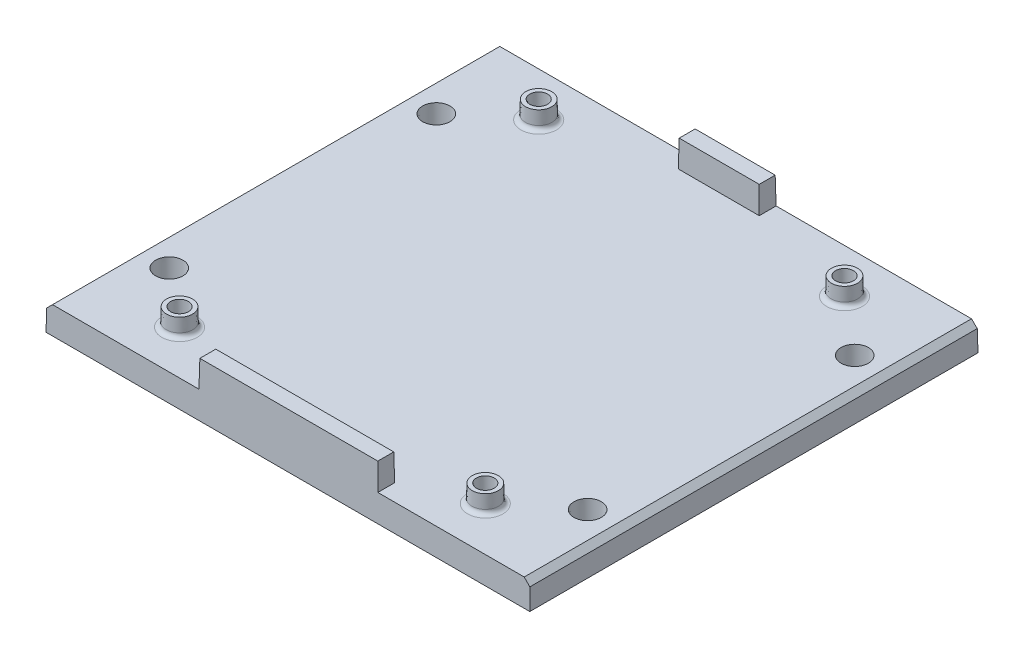
ISO-10303-21;
HEADER;
FILE_DESCRIPTION(('STEP AP214'),'2;1');
FILE_NAME('part.step','',(''),(''),'','','');
FILE_SCHEMA(('AUTOMOTIVE_DESIGN { 1 0 10303 214 1 1 1 1 }'));
ENDSEC;
DATA;
#1=APPLICATION_CONTEXT('core data for automotive mechanical design processes');
#2=APPLICATION_PROTOCOL_DEFINITION('international standard','automotive_design',2000,#1);
#3=PRODUCT_CONTEXT('',#1,'mechanical');
#4=PRODUCT('Part','Part','',(#3));
#5=PRODUCT_RELATED_PRODUCT_CATEGORY('part','',(#4));
#6=PRODUCT_DEFINITION_FORMATION('','',#4);
#7=PRODUCT_DEFINITION_CONTEXT('part definition',#1,'design');
#8=PRODUCT_DEFINITION('design','',#6,#7);
#9=PRODUCT_DEFINITION_SHAPE('','',#8);
#10=(LENGTH_UNIT() NAMED_UNIT(*) SI_UNIT(.MILLI.,.METRE.));
#11=(NAMED_UNIT(*) PLANE_ANGLE_UNIT() SI_UNIT($,.RADIAN.));
#12=(NAMED_UNIT(*) SI_UNIT($,.STERADIAN.) SOLID_ANGLE_UNIT());
#13=UNCERTAINTY_MEASURE_WITH_UNIT(LENGTH_MEASURE(1.E-05),#10,'distance_accuracy_value','');
#14=(GEOMETRIC_REPRESENTATION_CONTEXT(3) GLOBAL_UNCERTAINTY_ASSIGNED_CONTEXT((#13)) GLOBAL_UNIT_ASSIGNED_CONTEXT((#10,
#11,#12)) REPRESENTATION_CONTEXT('',''));
#15=CARTESIAN_POINT('',(0.,0.,0.));
#16=DIRECTION('',(0.,0.,1.));
#17=DIRECTION('',(1.,0.,0.));
#18=AXIS2_PLACEMENT_3D('',#15,#16,#17);
#19=CARTESIAN_POINT('',(0.,3.,0.));
#20=DIRECTION('',(0.,1.,0.));
#21=DIRECTION('',(0.,0.,1.));
#22=AXIS2_PLACEMENT_3D('',#19,#20,#21);
#23=PLANE('',#22);
#24=CARTESIAN_POINT('',(47.1745506492822,3.,-4.82544935071782));
#25=DIRECTION('',(0.,1.,0.));
#26=DIRECTION('',(0.,0.,1.));
#27=AXIS2_PLACEMENT_3D('',#24,#25,#26);
#28=CIRCLE('',#27,1.99134863155785);
#29=CARTESIAN_POINT('',(47.1745506492822,3.,-2.83410071915998));
#30=VERTEX_POINT('',#29);
#31=EDGE_CURVE('E260',#30,#30,#28,.F.);
#32=ORIENTED_EDGE('',*,*,#31,.T.);
#33=EDGE_LOOP('',(#32));
#34=FACE_BOUND('',#33,.T.);
#35=CARTESIAN_POINT('',(12.8254493507178,3.,-45.1745506492822));
#36=DIRECTION('',(0.,1.,0.));
#37=DIRECTION('',(0.,0.,1.));
#38=AXIS2_PLACEMENT_3D('',#35,#36,#37);
#39=CIRCLE('',#38,1.99134863155785);
#40=CARTESIAN_POINT('',(12.8254493507178,3.,-43.1832020177243));
#41=VERTEX_POINT('',#40);
#42=EDGE_CURVE('E263',#41,#41,#39,.F.);
#43=ORIENTED_EDGE('',*,*,#42,.T.);
#44=EDGE_LOOP('',(#43));
#45=FACE_BOUND('',#44,.T.);
#46=CARTESIAN_POINT('',(47.1745506492822,3.,-45.1745506492822));
#47=DIRECTION('',(0.,1.,0.));
#48=DIRECTION('',(0.,0.,1.));
#49=AXIS2_PLACEMENT_3D('',#46,#47,#48);
#50=CIRCLE('',#49,1.99134863155785);
#51=CARTESIAN_POINT('',(47.1745506492822,3.,-43.1832020177243));
#52=VERTEX_POINT('',#51);
#53=EDGE_CURVE('E266',#52,#52,#50,.F.);
#54=ORIENTED_EDGE('',*,*,#53,.T.);
#55=EDGE_LOOP('',(#54));
#56=FACE_BOUND('',#55,.T.);
#57=CARTESIAN_POINT('',(12.8254493507178,3.,-4.82544935071782));
#58=DIRECTION('',(0.,1.,0.));
#59=DIRECTION('',(0.,0.,1.));
#60=AXIS2_PLACEMENT_3D('',#57,#58,#59);
#61=CIRCLE('',#60,1.99134863155785);
#62=CARTESIAN_POINT('',(12.8254493507178,3.,-2.83410071915998));
#63=VERTEX_POINT('',#62);
#64=EDGE_CURVE('E269',#63,#63,#61,.F.);
#65=ORIENTED_EDGE('',*,*,#64,.T.);
#66=EDGE_LOOP('',(#65));
#67=FACE_BOUND('',#66,.T.);
#68=CARTESIAN_POINT('',(53.5,3.,-40.));
#69=DIRECTION('',(0.,1.,0.));
#70=DIRECTION('',(0.,0.,1.));
#71=AXIS2_PLACEMENT_3D('',#68,#69,#70);
#72=CIRCLE('',#71,1.53491012985645);
#73=CARTESIAN_POINT('',(53.5,3.,-38.4650898701436));
#74=VERTEX_POINT('',#73);
#75=EDGE_CURVE('E242',#74,#74,#72,.T.);
#76=ORIENTED_EDGE('',*,*,#75,.F.);
#77=EDGE_LOOP('',(#76));
#78=FACE_BOUND('',#77,.T.);
#79=CARTESIAN_POINT('',(53.5,3.,-10.));
#80=DIRECTION('',(0.,1.,0.));
#81=DIRECTION('',(0.,0.,1.));
#82=AXIS2_PLACEMENT_3D('',#79,#80,#81);
#83=CIRCLE('',#82,1.53491012985645);
#84=CARTESIAN_POINT('',(53.5,3.,-8.46508987014355));
#85=VERTEX_POINT('',#84);
#86=EDGE_CURVE('E286',#85,#85,#83,.T.);
#87=ORIENTED_EDGE('',*,*,#86,.F.);
#88=EDGE_LOOP('',(#87));
#89=FACE_BOUND('',#88,.T.);
#90=CARTESIAN_POINT('',(6.5,3.,-10.));
#91=DIRECTION('',(0.,1.,0.));
#92=DIRECTION('',(0.,0.,1.));
#93=AXIS2_PLACEMENT_3D('',#90,#91,#92);
#94=CIRCLE('',#93,1.53491012985644);
#95=CARTESIAN_POINT('',(6.5,3.,-8.46508987014357));
#96=VERTEX_POINT('',#95);
#97=EDGE_CURVE('E292',#96,#96,#94,.T.);
#98=ORIENTED_EDGE('',*,*,#97,.F.);
#99=EDGE_LOOP('',(#98));
#100=FACE_BOUND('',#99,.T.);
#101=CARTESIAN_POINT('',(6.5,3.,-40.));
#102=DIRECTION('',(0.,1.,0.));
#103=DIRECTION('',(0.,0.,1.));
#104=AXIS2_PLACEMENT_3D('',#101,#102,#103);
#105=CIRCLE('',#104,1.53491012985644);
#106=CARTESIAN_POINT('',(6.5,3.,-38.4650898701436));
#107=VERTEX_POINT('',#106);
#108=EDGE_CURVE('E279',#107,#107,#105,.T.);
#109=ORIENTED_EDGE('',*,*,#108,.F.);
#110=EDGE_LOOP('',(#109));
#111=FACE_BOUND('',#110,.T.);
#112=DIRECTION('',(-1.,0.,0.));
#113=VECTOR('',#112,1.);
#114=CARTESIAN_POINT('',(0.,3.,0.122185454497519));
#115=LINE('',#114,#113);
#116=CARTESIAN_POINT('',(40.0476348052153,3.,0.122185454497522));
#117=VERTEX_POINT('',#116);
#118=CARTESIAN_POINT('',(56.4945506492822,3.,0.122185454497523));
#119=VERTEX_POINT('',#118);
#120=EDGE_CURVE('E160',#117,#119,#115,.F.);
#121=ORIENTED_EDGE('',*,*,#120,.T.);
#122=DIRECTION('',(0.,0.,-1.));
#123=VECTOR('',#122,1.);
#124=CARTESIAN_POINT('',(56.4945506492822,3.,0.));
#125=LINE('',#124,#123);
#126=CARTESIAN_POINT('',(56.4945506492822,3.,-50.1221854544975));
#127=VERTEX_POINT('',#126);
#128=EDGE_CURVE('E217',#119,#127,#125,.T.);
#129=ORIENTED_EDGE('',*,*,#128,.T.);
#130=DIRECTION('',(1.,0.,0.));
#131=VECTOR('',#130,1.);
#132=CARTESIAN_POINT('',(0.,3.,-50.1221854544975));
#133=LINE('',#132,#131);
#134=CARTESIAN_POINT('',(34.5476348052153,3.,-50.1221854544975));
#135=VERTEX_POINT('',#134);
#136=EDGE_CURVE('E213',#135,#127,#133,.T.);
#137=ORIENTED_EDGE('',*,*,#136,.F.);
#138=DIRECTION('',(0.,0.,1.));
#139=VECTOR('',#138,1.);
#140=CARTESIAN_POINT('',(34.5476348052153,3.,0.));
#141=LINE('',#140,#139);
#142=CARTESIAN_POINT('',(34.5476348052153,3.,-48.2269158440668));
#143=VERTEX_POINT('',#142);
#144=EDGE_CURVE('E204',#143,#135,#141,.F.);
#145=ORIENTED_EDGE('',*,*,#144,.F.);
#146=DIRECTION('',(-1.,0.,0.));
#147=VECTOR('',#146,1.);
#148=CARTESIAN_POINT('',(0.,3.,-48.2269158440668));
#149=LINE('',#148,#147);
#150=CARTESIAN_POINT('',(25.4523651947846,3.,-48.2269158440668));
#151=VERTEX_POINT('',#150);
#152=EDGE_CURVE('E190',#151,#143,#149,.F.);
#153=ORIENTED_EDGE('',*,*,#152,.F.);
#154=DIRECTION('',(0.,0.,-1.));
#155=VECTOR('',#154,1.);
#156=CARTESIAN_POINT('',(25.4523651947846,3.,0.));
#157=LINE('',#156,#155);
#158=CARTESIAN_POINT('',(25.4523651947846,3.,-50.1221854544975));
#159=VERTEX_POINT('',#158);
#160=EDGE_CURVE('E196',#159,#151,#157,.F.);
#161=ORIENTED_EDGE('',*,*,#160,.F.);
#162=DIRECTION('',(1.,0.,0.));
#163=VECTOR('',#162,1.);
#164=CARTESIAN_POINT('',(0.,3.,-50.1221854544975));
#165=LINE('',#164,#163);
#166=CARTESIAN_POINT('',(3.50544935071782,3.,-50.1221854544975));
#167=VERTEX_POINT('',#166);
#168=EDGE_CURVE('E209',#167,#159,#165,.T.);
#169=ORIENTED_EDGE('',*,*,#168,.F.);
#170=DIRECTION('',(0.,0.,1.));
#171=VECTOR('',#170,1.);
#172=CARTESIAN_POINT('',(3.50544935071782,3.,0.174550649282172));
#173=LINE('',#172,#171);
#174=CARTESIAN_POINT('',(3.50544935071782,3.,0.122185454497519));
#175=VERTEX_POINT('',#174);
#176=EDGE_CURVE('E167',#167,#175,#173,.T.);
#177=ORIENTED_EDGE('',*,*,#176,.T.);
#178=DIRECTION('',(-1.,0.,0.));
#179=VECTOR('',#178,1.);
#180=CARTESIAN_POINT('',(0.,3.,0.122185454497519));
#181=LINE('',#180,#179);
#182=CARTESIAN_POINT('',(19.9523651947847,3.,0.122185454497521));
#183=VERTEX_POINT('',#182);
#184=EDGE_CURVE('E163',#175,#183,#181,.F.);
#185=ORIENTED_EDGE('',*,*,#184,.T.);
#186=DIRECTION('',(0.,0.,-1.));
#187=VECTOR('',#186,1.);
#188=CARTESIAN_POINT('',(19.9523651947847,3.,0.));
#189=LINE('',#188,#187);
#190=CARTESIAN_POINT('',(19.9523651947847,3.,-1.77308415593317));
#191=VERTEX_POINT('',#190);
#192=EDGE_CURVE('E155',#191,#183,#189,.F.);
#193=ORIENTED_EDGE('',*,*,#192,.F.);
#194=DIRECTION('',(1.,0.,0.));
#195=VECTOR('',#194,1.);
#196=CARTESIAN_POINT('',(0.,3.,-1.77308415593317));
#197=LINE('',#196,#195);
#198=CARTESIAN_POINT('',(40.0476348052153,3.,-1.77308415593317));
#199=VERTEX_POINT('',#198);
#200=EDGE_CURVE('E142',#199,#191,#197,.F.);
#201=ORIENTED_EDGE('',*,*,#200,.F.);
#202=DIRECTION('',(0.,0.,1.));
#203=VECTOR('',#202,1.);
#204=CARTESIAN_POINT('',(40.0476348052153,3.,0.));
#205=LINE('',#204,#203);
#206=EDGE_CURVE('E152',#117,#199,#205,.F.);
#207=ORIENTED_EDGE('',*,*,#206,.F.);
#208=EDGE_LOOP('',(#121,#129,#137,#145,#153,#161,#169,#177,#185,#193,#201,#207));
#209=FACE_BOUND('',#208,.T.);
#210=ADVANCED_FACE('F42',(#34,#45,#56,#67,#78,#89,#100,#111,#209),#23,.T.);
#211=CARTESIAN_POINT('',(2.82544935071782,0.,0.));
#212=DIRECTION('',(-0.999847695156391,0.0174524064372835,0.));
#213=DIRECTION('',(-0.0174524064372835,-0.999847695156391,0.));
#214=AXIS2_PLACEMENT_3D('',#211,#212,#213);
#215=PLANE('',#214);
#216=DIRECTION('',(-0.0174497491606827,-0.999695459881887,0.0174497491606827));
#217=VECTOR('',#216,1.);
#218=CARTESIAN_POINT('',(2.82458901906154,-0.0492883675783294,0.175410980938458));
#219=LINE('',#218,#217);
#220=CARTESIAN_POINT('',(2.86666451471488,2.36121516399706,0.133335485285111));
#221=VERTEX_POINT('',#220);
#222=CARTESIAN_POINT('',(2.82544935071782,0.,0.174550649282172));
#223=VERTEX_POINT('',#222);
#224=EDGE_CURVE('E234',#221,#223,#219,.T.);
#225=ORIENTED_EDGE('',*,*,#224,.F.);
#226=DIRECTION('',(0.,0.,1.));
#227=VECTOR('',#226,1.);
#228=CARTESIAN_POINT('',(2.86666451471488,2.36121516399706,0.));
#229=LINE('',#228,#227);
#230=CARTESIAN_POINT('',(2.86666451471488,2.36121516399706,-50.1333354852851));
#231=VERTEX_POINT('',#230);
#232=EDGE_CURVE('E61',#221,#231,#229,.F.);
#233=ORIENTED_EDGE('',*,*,#232,.T.);
#234=DIRECTION('',(0.0174497491606827,0.999695459881887,0.0174497491606827));
#235=VECTOR('',#234,1.);
#236=CARTESIAN_POINT('',(2.82458901906154,-0.0492883675783293,-50.1754109809385));
#237=LINE('',#236,#235);
#238=CARTESIAN_POINT('',(2.82544935071782,0.,-50.1745506492822));
#239=VERTEX_POINT('',#238);
#240=EDGE_CURVE('E212',#231,#239,#237,.F.);
#241=ORIENTED_EDGE('',*,*,#240,.T.);
#242=DIRECTION('',(0.,0.,-1.));
#243=VECTOR('',#242,1.);
#244=CARTESIAN_POINT('',(2.82544935071782,0.,0.));
#245=LINE('',#244,#243);
#246=EDGE_CURVE('E175',#239,#223,#245,.F.);
#247=ORIENTED_EDGE('',*,*,#246,.T.);
#248=EDGE_LOOP('',(#225,#233,#241,#247));
#249=FACE_BOUND('',#248,.T.);
#250=ADVANCED_FACE('F358',(#249),#215,.T.);
#251=CARTESIAN_POINT('',(0.,0.,0.174550649282172));
#252=DIRECTION('',(0.,0.0174524064372835,0.999847695156391));
#253=DIRECTION('',(0.,-0.999847695156391,0.0174524064372835));
#254=AXIS2_PLACEMENT_3D('',#251,#252,#253);
#255=PLANE('',#254);
#256=DIRECTION('',(-0.0174497491606827,0.999695459881887,-0.0174497491606827));
#257=VECTOR('',#256,1.);
#258=CARTESIAN_POINT('',(57.1571413561922,0.997377733142408,0.157141356192217));
#259=LINE('',#258,#257);
#260=CARTESIAN_POINT('',(57.1333354852851,2.36121516399706,0.133335485285115));
#261=VERTEX_POINT('',#260);
#262=CARTESIAN_POINT('',(57.1745506492822,0.,0.174550649282176));
#263=VERTEX_POINT('',#262);
#264=EDGE_CURVE('E246',#261,#263,#259,.F.);
#265=ORIENTED_EDGE('',*,*,#264,.F.);
#266=DIRECTION('',(-0.707052927141246,0.707052927141246,-0.0123416547509368));
#267=VECTOR('',#266,1.);
#268=CARTESIAN_POINT('',(56.7355475387169,2.75900311056523,0.126392070850107));
#269=LINE('',#268,#267);
#270=EDGE_CURVE('E165',#261,#119,#269,.T.);
#271=ORIENTED_EDGE('',*,*,#270,.T.);
#272=ORIENTED_EDGE('',*,*,#120,.F.);
#273=DIRECTION('',(0.0174497491606827,-0.999695459881887,0.0174497491606827));
#274=VECTOR('',#273,1.);
#275=CARTESIAN_POINT('',(40.099946850419,0.00304493745770745,0.174497499701148));
#276=LINE('',#275,#274);
#277=CARTESIAN_POINT('',(39.9952696104307,6.,0.0698202597128692));
#278=VERTEX_POINT('',#277);
#279=EDGE_CURVE('E239',#278,#117,#276,.T.);
#280=ORIENTED_EDGE('',*,*,#279,.F.);
#281=DIRECTION('',(-1.,0.,0.));
#282=VECTOR('',#281,1.);
#283=CARTESIAN_POINT('',(0.,6.,0.0698202597128662));
#284=LINE('',#283,#282);
#285=CARTESIAN_POINT('',(20.0047303895693,6.,0.0698202597128677));
#286=VERTEX_POINT('',#285);
#287=EDGE_CURVE('E150',#286,#278,#284,.F.);
#288=ORIENTED_EDGE('',*,*,#287,.F.);
#289=DIRECTION('',(-0.0174497491606827,-0.999695459881887,0.0174497491606827));
#290=VECTOR('',#289,1.);
#291=CARTESIAN_POINT('',(19.8939405744592,-0.347144256739045,0.180610074823011));
#292=LINE('',#291,#290);
#293=EDGE_CURVE('E149',#286,#183,#292,.T.);
#294=ORIENTED_EDGE('',*,*,#293,.T.);
#295=ORIENTED_EDGE('',*,*,#184,.F.);
#296=DIRECTION('',(0.707052927141246,0.707052927141246,-0.0123416547509367));
#297=VECTOR('',#296,1.);
#298=CARTESIAN_POINT('',(3.50651556581176,3.00106621509394,0.122166843643827));
#299=LINE('',#298,#297);
#300=EDGE_CURVE('E168',#175,#221,#299,.F.);
#301=ORIENTED_EDGE('',*,*,#300,.T.);
#302=ORIENTED_EDGE('',*,*,#224,.T.);
#303=DIRECTION('',(-1.,0.,0.));
#304=VECTOR('',#303,1.);
#305=CARTESIAN_POINT('',(0.,0.,0.174550649282172));
#306=LINE('',#305,#304);
#307=EDGE_CURVE('E172',#223,#263,#306,.F.);
#308=ORIENTED_EDGE('',*,*,#307,.T.);
#309=EDGE_LOOP('',(#265,#271,#272,#280,#288,#294,#295,#301,#302,#308));
#310=FACE_BOUND('',#309,.T.);
#311=ADVANCED_FACE('F44',(#310),#255,.T.);
#312=CARTESIAN_POINT('',(57.1745506492822,0.,0.));
#313=DIRECTION('',(0.999847695156391,0.0174524064372835,0.));
#314=DIRECTION('',(-0.0174524064372835,0.999847695156391,0.));
#315=AXIS2_PLACEMENT_3D('',#312,#313,#314);
#316=PLANE('',#315);
#317=DIRECTION('',(0.0174497491606827,-0.999695459881887,-0.0174497491606827));
#318=VECTOR('',#317,1.);
#319=CARTESIAN_POINT('',(57.1571413561922,0.997377733142408,-50.1571413561922));
#320=LINE('',#319,#318);
#321=CARTESIAN_POINT('',(57.1333354852851,2.36121516399706,-50.1333354852851));
#322=VERTEX_POINT('',#321);
#323=CARTESIAN_POINT('',(57.1745506492822,0.,-50.1745506492822));
#324=VERTEX_POINT('',#323);
#325=EDGE_CURVE('E252',#322,#324,#320,.T.);
#326=ORIENTED_EDGE('',*,*,#325,.F.);
#327=DIRECTION('',(0.,0.,-1.));
#328=VECTOR('',#327,1.);
#329=CARTESIAN_POINT('',(57.1333354852851,2.36121516399706,0.));
#330=LINE('',#329,#328);
#331=EDGE_CURVE('E220',#322,#261,#330,.F.);
#332=ORIENTED_EDGE('',*,*,#331,.T.);
#333=ORIENTED_EDGE('',*,*,#264,.T.);
#334=DIRECTION('',(0.,0.,1.));
#335=VECTOR('',#334,1.);
#336=CARTESIAN_POINT('',(57.1745506492822,0.,0.));
#337=LINE('',#336,#335);
#338=EDGE_CURVE('E169',#324,#263,#337,.T.);
#339=ORIENTED_EDGE('',*,*,#338,.F.);
#340=EDGE_LOOP('',(#326,#332,#333,#339));
#341=FACE_BOUND('',#340,.T.);
#342=ADVANCED_FACE('F402',(#341),#316,.T.);
#343=CARTESIAN_POINT('',(0.,0.,-50.1745506492822));
#344=DIRECTION('',(0.,0.0174524064372835,-0.999847695156391));
#345=DIRECTION('',(0.,0.999847695156391,0.0174524064372835));
#346=AXIS2_PLACEMENT_3D('',#343,#344,#345);
#347=PLANE('',#346);
#348=ORIENTED_EDGE('',*,*,#136,.T.);
#349=DIRECTION('',(-0.707052927141246,0.707052927141246,0.0123416547509367));
#350=VECTOR('',#349,1.);
#351=CARTESIAN_POINT('',(29.7518063237775,29.7427443255047,-49.6553891159371));
#352=LINE('',#351,#350);
#353=EDGE_CURVE('E216',#127,#322,#352,.F.);
#354=ORIENTED_EDGE('',*,*,#353,.T.);
#355=ORIENTED_EDGE('',*,*,#325,.T.);
#356=DIRECTION('',(1.,0.,0.));
#357=VECTOR('',#356,1.);
#358=CARTESIAN_POINT('',(0.,0.,-50.1745506492822));
#359=LINE('',#358,#357);
#360=EDGE_CURVE('E164',#239,#324,#359,.T.);
#361=ORIENTED_EDGE('',*,*,#360,.F.);
#362=ORIENTED_EDGE('',*,*,#240,.F.);
#363=DIRECTION('',(0.707052927141246,0.707052927141246,0.0123416547509369));
#364=VECTOR('',#363,1.);
#365=CARTESIAN_POINT('',(0.252763169482269,-0.252686181235554,-50.1789613029821));
#366=LINE('',#365,#364);
#367=EDGE_CURVE('E214',#231,#167,#366,.T.);
#368=ORIENTED_EDGE('',*,*,#367,.T.);
#369=ORIENTED_EDGE('',*,*,#168,.T.);
#370=DIRECTION('',(0.0174497491606827,0.999695459881887,0.0174497491606827));
#371=VECTOR('',#370,1.);
#372=CARTESIAN_POINT('',(25.3922658588574,-0.443088649305112,-50.1822847904248));
#373=LINE('',#372,#371);
#374=CARTESIAN_POINT('',(25.5047303895693,6.,-50.0698202597129));
#375=VERTEX_POINT('',#374);
#376=EDGE_CURVE('E238',#375,#159,#373,.F.);
#377=ORIENTED_EDGE('',*,*,#376,.F.);
#378=DIRECTION('',(-1.,0.,0.));
#379=VECTOR('',#378,1.);
#380=CARTESIAN_POINT('',(0.,6.,-50.0698202597129));
#381=LINE('',#380,#379);
#382=CARTESIAN_POINT('',(34.4952696104307,6.,-50.0698202597129));
#383=VERTEX_POINT('',#382);
#384=EDGE_CURVE('E181',#383,#375,#381,.T.);
#385=ORIENTED_EDGE('',*,*,#384,.F.);
#386=DIRECTION('',(-0.0174497491606827,0.999695459881887,0.0174497491606827));
#387=VECTOR('',#386,1.);
#388=CARTESIAN_POINT('',(34.5847221631304,0.875266688058322,-50.1592728124126));
#389=LINE('',#388,#387);
#390=EDGE_CURVE('E247',#383,#135,#389,.F.);
#391=ORIENTED_EDGE('',*,*,#390,.T.);
#392=EDGE_LOOP('',(#348,#354,#355,#361,#362,#368,#369,#377,#385,#391));
#393=FACE_BOUND('',#392,.T.);
#394=ADVANCED_FACE('F373',(#393),#347,.T.);
#395=CARTESIAN_POINT('',(0.,0.,0.));
#396=DIRECTION('',(0.,1.,0.));
#397=DIRECTION('',(0.,0.,1.));
#398=AXIS2_PLACEMENT_3D('',#395,#396,#397);
#399=PLANE('',#398);
#400=CARTESIAN_POINT('',(53.5,0.,-40.));
#401=DIRECTION('',(0.,1.,0.));
#402=DIRECTION('',(0.,0.,1.));
#403=AXIS2_PLACEMENT_3D('',#400,#401,#402);
#404=CIRCLE('',#403,1.4825449350718);
#405=CARTESIAN_POINT('',(53.5,0.,-38.5174550649282));
#406=VERTEX_POINT('',#405);
#407=EDGE_CURVE('E283',#406,#406,#404,.T.);
#408=ORIENTED_EDGE('',*,*,#407,.T.);
#409=EDGE_LOOP('',(#408));
#410=FACE_BOUND('',#409,.T.);
#411=CARTESIAN_POINT('',(53.5,0.,-10.));
#412=DIRECTION('',(0.,1.,0.));
#413=DIRECTION('',(0.,0.,1.));
#414=AXIS2_PLACEMENT_3D('',#411,#412,#413);
#415=CIRCLE('',#414,1.4825449350718);
#416=CARTESIAN_POINT('',(53.5,0.,-8.5174550649282));
#417=VERTEX_POINT('',#416);
#418=EDGE_CURVE('E289',#417,#417,#415,.T.);
#419=ORIENTED_EDGE('',*,*,#418,.T.);
#420=EDGE_LOOP('',(#419));
#421=FACE_BOUND('',#420,.T.);
#422=CARTESIAN_POINT('',(6.5,0.,-10.));
#423=DIRECTION('',(0.,1.,0.));
#424=DIRECTION('',(0.,0.,1.));
#425=AXIS2_PLACEMENT_3D('',#422,#423,#424);
#426=CIRCLE('',#425,1.48254493507178);
#427=CARTESIAN_POINT('',(6.5,0.,-8.51745506492822));
#428=VERTEX_POINT('',#427);
#429=EDGE_CURVE('E282',#428,#428,#426,.T.);
#430=ORIENTED_EDGE('',*,*,#429,.T.);
#431=EDGE_LOOP('',(#430));
#432=FACE_BOUND('',#431,.T.);
#433=CARTESIAN_POINT('',(6.5,0.,-40.));
#434=DIRECTION('',(0.,1.,0.));
#435=DIRECTION('',(0.,0.,1.));
#436=AXIS2_PLACEMENT_3D('',#433,#434,#435);
#437=CIRCLE('',#436,1.48254493507178);
#438=CARTESIAN_POINT('',(6.5,0.,-38.5174550649282));
#439=VERTEX_POINT('',#438);
#440=EDGE_CURVE('E178',#439,#439,#437,.T.);
#441=ORIENTED_EDGE('',*,*,#440,.T.);
#442=EDGE_LOOP('',(#441));
#443=FACE_BOUND('',#442,.T.);
#444=ORIENTED_EDGE('',*,*,#246,.F.);
#445=ORIENTED_EDGE('',*,*,#360,.T.);
#446=ORIENTED_EDGE('',*,*,#338,.T.);
#447=ORIENTED_EDGE('',*,*,#307,.F.);
#448=EDGE_LOOP('',(#444,#445,#446,#447));
#449=FACE_BOUND('',#448,.T.);
#450=ADVANCED_FACE('F370',(#410,#421,#432,#443,#449),#399,.F.);
#451=CARTESIAN_POINT('',(6.5,3.,-40.));
#452=DIRECTION('',(0.,1.,0.));
#453=DIRECTION('',(0.,0.,1.));
#454=AXIS2_PLACEMENT_3D('',#451,#452,#453);
#455=CONICAL_SURFACE('',#454,1.53491012985644,0.0174532925199433);
#456=ORIENTED_EDGE('',*,*,#440,.F.);
#457=EDGE_LOOP('',(#456));
#458=FACE_BOUND('',#457,.T.);
#459=ORIENTED_EDGE('',*,*,#108,.T.);
#460=EDGE_LOOP('',(#459));
#461=FACE_BOUND('',#460,.T.);
#462=ADVANCED_FACE('F368',(#458,#461),#455,.F.);
#463=CARTESIAN_POINT('',(6.5,3.,-10.));
#464=DIRECTION('',(0.,1.,0.));
#465=DIRECTION('',(0.,0.,1.));
#466=AXIS2_PLACEMENT_3D('',#463,#464,#465);
#467=CONICAL_SURFACE('',#466,1.53491012985644,0.0174532925199433);
#468=ORIENTED_EDGE('',*,*,#429,.F.);
#469=EDGE_LOOP('',(#468));
#470=FACE_BOUND('',#469,.T.);
#471=ORIENTED_EDGE('',*,*,#97,.T.);
#472=EDGE_LOOP('',(#471));
#473=FACE_BOUND('',#472,.T.);
#474=ADVANCED_FACE('F433',(#470,#473),#467,.F.);
#475=CARTESIAN_POINT('',(53.5,3.,-10.));
#476=DIRECTION('',(0.,1.,0.));
#477=DIRECTION('',(0.,0.,1.));
#478=AXIS2_PLACEMENT_3D('',#475,#476,#477);
#479=CONICAL_SURFACE('',#478,1.53491012985645,0.0174532925199433);
#480=ORIENTED_EDGE('',*,*,#418,.F.);
#481=EDGE_LOOP('',(#480));
#482=FACE_BOUND('',#481,.T.);
#483=ORIENTED_EDGE('',*,*,#86,.T.);
#484=EDGE_LOOP('',(#483));
#485=FACE_BOUND('',#484,.T.);
#486=ADVANCED_FACE('F436',(#482,#485),#479,.F.);
#487=CARTESIAN_POINT('',(53.5,3.,-40.));
#488=DIRECTION('',(0.,1.,0.));
#489=DIRECTION('',(0.,0.,1.));
#490=AXIS2_PLACEMENT_3D('',#487,#488,#489);
#491=CONICAL_SURFACE('',#490,1.53491012985645,0.0174532925199433);
#492=ORIENTED_EDGE('',*,*,#407,.F.);
#493=EDGE_LOOP('',(#492));
#494=FACE_BOUND('',#493,.T.);
#495=ORIENTED_EDGE('',*,*,#75,.T.);
#496=EDGE_LOOP('',(#495));
#497=FACE_BOUND('',#496,.T.);
#498=ADVANCED_FACE('F422',(#494,#497),#491,.F.);
#499=CARTESIAN_POINT('',(19.9,0.,0.));
#500=DIRECTION('',(-0.999847695156391,0.0174524064372835,0.));
#501=DIRECTION('',(-0.0174524064372835,-0.999847695156391,0.));
#502=AXIS2_PLACEMENT_3D('',#499,#500,#501);
#503=PLANE('',#502);
#504=ORIENTED_EDGE('',*,*,#192,.T.);
#505=ORIENTED_EDGE('',*,*,#293,.F.);
#506=DIRECTION('',(0.,0.,-1.));
#507=VECTOR('',#506,1.);
#508=CARTESIAN_POINT('',(20.0047303895693,6.,0.));
#509=LINE('',#508,#507);
#510=CARTESIAN_POINT('',(20.0047303895693,6.,-1.72071896114852));
#511=VERTEX_POINT('',#510);
#512=EDGE_CURVE('E46',#511,#286,#509,.F.);
#513=ORIENTED_EDGE('',*,*,#512,.F.);
#514=DIRECTION('',(-0.0174497491606827,-0.999695459881887,-0.0174497491606827));
#515=VECTOR('',#514,1.);
#516=CARTESIAN_POINT('',(19.9005558379105,0.0318439325663171,-1.82489351280731));
#517=LINE('',#516,#515);
#518=EDGE_CURVE('E138',#511,#191,#517,.T.);
#519=ORIENTED_EDGE('',*,*,#518,.T.);
#520=EDGE_LOOP('',(#504,#505,#513,#519));
#521=FACE_BOUND('',#520,.T.);
#522=ADVANCED_FACE('F147',(#521),#503,.T.);
#523=CARTESIAN_POINT('',(40.1,0.,0.));
#524=DIRECTION('',(0.999847695156391,0.0174524064372835,0.));
#525=DIRECTION('',(-0.0174524064372835,0.999847695156391,0.));
#526=AXIS2_PLACEMENT_3D('',#523,#524,#525);
#527=PLANE('',#526);
#528=ORIENTED_EDGE('',*,*,#206,.T.);
#529=DIRECTION('',(0.0174497491606827,-0.999695459881887,-0.0174497491606827));
#530=VECTOR('',#529,1.);
#531=CARTESIAN_POINT('',(40.0877898007946,0.699521843981693,-1.81323915151242));
#532=LINE('',#531,#530);
#533=CARTESIAN_POINT('',(39.9952696104307,6.,-1.72071896114852));
#534=VERTEX_POINT('',#533);
#535=EDGE_CURVE('E145',#534,#199,#532,.T.);
#536=ORIENTED_EDGE('',*,*,#535,.F.);
#537=DIRECTION('',(0.,0.,1.));
#538=VECTOR('',#537,1.);
#539=CARTESIAN_POINT('',(39.9952696104307,6.,0.));
#540=LINE('',#539,#538);
#541=EDGE_CURVE('E134',#278,#534,#540,.F.);
#542=ORIENTED_EDGE('',*,*,#541,.F.);
#543=ORIENTED_EDGE('',*,*,#279,.T.);
#544=EDGE_LOOP('',(#528,#536,#542,#543));
#545=FACE_BOUND('',#544,.T.);
#546=ADVANCED_FACE('F421',(#545),#527,.T.);
#547=CARTESIAN_POINT('',(0.,0.,-1.82544935071783));
#548=DIRECTION('',(0.,0.0174524064372835,-0.999847695156391));
#549=DIRECTION('',(0.,0.999847695156391,0.0174524064372835));
#550=AXIS2_PLACEMENT_3D('',#547,#548,#549);
#551=PLANE('',#550);
#552=ORIENTED_EDGE('',*,*,#200,.T.);
#553=ORIENTED_EDGE('',*,*,#518,.F.);
#554=DIRECTION('',(1.,0.,0.));
#555=VECTOR('',#554,1.);
#556=CARTESIAN_POINT('',(0.,6.,-1.72071896114852));
#557=LINE('',#556,#555);
#558=EDGE_CURVE('E128',#534,#511,#557,.F.);
#559=ORIENTED_EDGE('',*,*,#558,.F.);
#560=ORIENTED_EDGE('',*,*,#535,.T.);
#561=EDGE_LOOP('',(#552,#553,#559,#560));
#562=FACE_BOUND('',#561,.T.);
#563=ADVANCED_FACE('F141',(#562),#551,.T.);
#564=CARTESIAN_POINT('',(0.,6.,0.));
#565=DIRECTION('',(0.,-1.,0.));
#566=DIRECTION('',(0.,0.,-1.));
#567=AXIS2_PLACEMENT_3D('',#564,#565,#566);
#568=PLANE('',#567);
#569=ORIENTED_EDGE('',*,*,#512,.T.);
#570=ORIENTED_EDGE('',*,*,#287,.T.);
#571=ORIENTED_EDGE('',*,*,#541,.T.);
#572=ORIENTED_EDGE('',*,*,#558,.T.);
#573=EDGE_LOOP('',(#569,#570,#571,#572));
#574=FACE_BOUND('',#573,.T.);
#575=ADVANCED_FACE('F130',(#574),#568,.F.);
#576=CARTESIAN_POINT('',(34.6,0.,0.));
#577=DIRECTION('',(0.999847695156391,0.0174524064372835,0.));
#578=DIRECTION('',(-0.0174524064372835,0.999847695156391,0.));
#579=AXIS2_PLACEMENT_3D('',#576,#577,#578);
#580=PLANE('',#579);
#581=ORIENTED_EDGE('',*,*,#144,.T.);
#582=ORIENTED_EDGE('',*,*,#390,.F.);
#583=DIRECTION('',(0.,0.,1.));
#584=VECTOR('',#583,1.);
#585=CARTESIAN_POINT('',(34.4952696104307,6.,0.));
#586=LINE('',#585,#584);
#587=CARTESIAN_POINT('',(34.4952696104307,6.,-48.2792810388515));
#588=VERTEX_POINT('',#587);
#589=EDGE_CURVE('E184',#588,#383,#586,.F.);
#590=ORIENTED_EDGE('',*,*,#589,.F.);
#591=DIRECTION('',(0.0174497491606827,-0.999695459881887,0.0174497491606827));
#592=VECTOR('',#591,1.);
#593=CARTESIAN_POINT('',(34.614668849378,-0.840377818034297,-48.1598817999042));
#594=LINE('',#593,#592);
#595=EDGE_CURVE('E188',#588,#143,#594,.T.);
#596=ORIENTED_EDGE('',*,*,#595,.T.);
#597=EDGE_LOOP('',(#581,#582,#590,#596));
#598=FACE_BOUND('',#597,.T.);
#599=ADVANCED_FACE('F410',(#598),#580,.T.);
#600=CARTESIAN_POINT('',(25.4,0.,0.));
#601=DIRECTION('',(-0.999847695156391,0.0174524064372835,0.));
#602=DIRECTION('',(-0.0174524064372835,-0.999847695156391,0.));
#603=AXIS2_PLACEMENT_3D('',#600,#601,#602);
#604=PLANE('',#603);
#605=ORIENTED_EDGE('',*,*,#160,.T.);
#606=DIRECTION('',(-0.0174497491606827,-0.999695459881887,0.0174497491606827));
#607=VECTOR('',#606,1.);
#608=CARTESIAN_POINT('',(25.3922658588574,-0.443088649305113,-48.1668165081396));
#609=LINE('',#608,#607);
#610=CARTESIAN_POINT('',(25.5047303895693,6.,-48.2792810388515));
#611=VERTEX_POINT('',#610);
#612=EDGE_CURVE('E236',#611,#151,#609,.T.);
#613=ORIENTED_EDGE('',*,*,#612,.F.);
#614=DIRECTION('',(0.,0.,-1.));
#615=VECTOR('',#614,1.);
#616=CARTESIAN_POINT('',(25.5047303895693,6.,0.));
#617=LINE('',#616,#615);
#618=EDGE_CURVE('E183',#375,#611,#617,.F.);
#619=ORIENTED_EDGE('',*,*,#618,.F.);
#620=ORIENTED_EDGE('',*,*,#376,.T.);
#621=EDGE_LOOP('',(#605,#613,#619,#620));
#622=FACE_BOUND('',#621,.T.);
#623=ADVANCED_FACE('F406',(#622),#604,.T.);
#624=CARTESIAN_POINT('',(0.,0.,-48.1745506492822));
#625=DIRECTION('',(0.,0.0174524064372835,0.999847695156391));
#626=DIRECTION('',(0.,-0.999847695156391,0.0174524064372835));
#627=AXIS2_PLACEMENT_3D('',#624,#625,#626);
#628=PLANE('',#627);
#629=ORIENTED_EDGE('',*,*,#152,.T.);
#630=ORIENTED_EDGE('',*,*,#595,.F.);
#631=DIRECTION('',(-1.,0.,0.));
#632=VECTOR('',#631,1.);
#633=CARTESIAN_POINT('',(0.,6.,-48.2792810388515));
#634=LINE('',#633,#632);
#635=EDGE_CURVE('E186',#611,#588,#634,.F.);
#636=ORIENTED_EDGE('',*,*,#635,.F.);
#637=ORIENTED_EDGE('',*,*,#612,.T.);
#638=EDGE_LOOP('',(#629,#630,#636,#637));
#639=FACE_BOUND('',#638,.T.);
#640=ADVANCED_FACE('F409',(#639),#628,.T.);
#641=CARTESIAN_POINT('',(0.,6.,0.));
#642=DIRECTION('',(0.,-1.,0.));
#643=DIRECTION('',(0.,0.,-1.));
#644=AXIS2_PLACEMENT_3D('',#641,#642,#643);
#645=PLANE('',#644);
#646=ORIENTED_EDGE('',*,*,#589,.T.);
#647=ORIENTED_EDGE('',*,*,#384,.T.);
#648=ORIENTED_EDGE('',*,*,#618,.T.);
#649=ORIENTED_EDGE('',*,*,#635,.T.);
#650=EDGE_LOOP('',(#646,#647,#648,#649));
#651=FACE_BOUND('',#650,.T.);
#652=ADVANCED_FACE('F380',(#651),#645,.F.);
#653=CARTESIAN_POINT('',(57.1745506492822,2.32,-50.1745506492822));
#654=DIRECTION('',(-0.707106781186548,-0.707106781186548,0.));
#655=DIRECTION('',(0.,0.,1.));
#656=AXIS2_PLACEMENT_3D('',#653,#654,#655);
#657=PLANE('',#656);
#658=ORIENTED_EDGE('',*,*,#353,.F.);
#659=ORIENTED_EDGE('',*,*,#128,.F.);
#660=ORIENTED_EDGE('',*,*,#270,.F.);
#661=ORIENTED_EDGE('',*,*,#331,.F.);
#662=EDGE_LOOP('',(#658,#659,#660,#661));
#663=FACE_BOUND('',#662,.T.);
#664=ADVANCED_FACE('F353',(#663),#657,.F.);
#665=CARTESIAN_POINT('',(3.50544935071782,3.,0.));
#666=DIRECTION('',(-0.707106781186548,0.707106781186548,0.));
#667=DIRECTION('',(0.,0.,-1.));
#668=AXIS2_PLACEMENT_3D('',#665,#666,#667);
#669=PLANE('',#668);
#670=ORIENTED_EDGE('',*,*,#367,.F.);
#671=ORIENTED_EDGE('',*,*,#232,.F.);
#672=ORIENTED_EDGE('',*,*,#300,.F.);
#673=ORIENTED_EDGE('',*,*,#176,.F.);
#674=EDGE_LOOP('',(#670,#671,#672,#673));
#675=FACE_BOUND('',#674,.T.);
#676=ADVANCED_FACE('F347',(#675),#669,.T.);
#677=CARTESIAN_POINT('',(12.8254493507178,3.,-45.1745506492822));
#678=DIRECTION('',(0.,-1.,0.));
#679=DIRECTION('',(0.,0.,1.));
#680=AXIS2_PLACEMENT_3D('',#677,#678,#679);
#681=CONICAL_SURFACE('',#680,1.5,0.0174532925199433);
#682=CARTESIAN_POINT('',(12.8254493507178,3.49127379678137,-45.1745506492822));
#683=DIRECTION('',(0.,1.,0.));
#684=DIRECTION('',(0.,0.,1.));
#685=AXIS2_PLACEMENT_3D('',#682,#683,#684);
#686=CIRCLE('',#685,1.49142478397965);
#687=CARTESIAN_POINT('',(12.8254493507178,3.49127379678137,-43.6831258653025));
#688=VERTEX_POINT('',#687);
#689=EDGE_CURVE('E257',#688,#688,#686,.T.);
#690=ORIENTED_EDGE('',*,*,#689,.T.);
#691=EDGE_LOOP('',(#690));
#692=FACE_BOUND('',#691,.T.);
#693=CARTESIAN_POINT('',(12.8254493507178,5.,-45.1745506492822));
#694=DIRECTION('',(0.,1.,0.));
#695=DIRECTION('',(0.,0.,1.));
#696=AXIS2_PLACEMENT_3D('',#693,#694,#695);
#697=CIRCLE('',#696,1.46508987014357);
#698=CARTESIAN_POINT('',(12.8254493507178,5.,-43.7094607791386));
#699=VERTEX_POINT('',#698);
#700=EDGE_CURVE('E299',#699,#699,#697,.T.);
#701=ORIENTED_EDGE('',*,*,#700,.F.);
#702=EDGE_LOOP('',(#701));
#703=FACE_BOUND('',#702,.T.);
#704=ADVANCED_FACE('F342',(#692,#703),#681,.T.);
#705=CARTESIAN_POINT('',(12.8254493507178,5.,-45.1745506492822));
#706=DIRECTION('',(0.,1.,0.));
#707=DIRECTION('',(0.,0.,1.));
#708=AXIS2_PLACEMENT_3D('',#705,#706,#707);
#709=PLANE('',#708);
#710=CARTESIAN_POINT('',(12.8254493507178,5.,-45.1745506492822));
#711=DIRECTION('',(0.,1.,0.));
#712=DIRECTION('',(0.,0.,1.));
#713=AXIS2_PLACEMENT_3D('',#710,#711,#712);
#714=CIRCLE('',#713,1.);
#715=CARTESIAN_POINT('',(12.8254493507178,5.,-44.1745506492822));
#716=VERTEX_POINT('',#715);
#717=EDGE_CURVE('E328',#716,#716,#714,.T.);
#718=ORIENTED_EDGE('',*,*,#717,.F.);
#719=EDGE_LOOP('',(#718));
#720=FACE_BOUND('',#719,.T.);
#721=ORIENTED_EDGE('',*,*,#700,.T.);
#722=EDGE_LOOP('',(#721));
#723=FACE_BOUND('',#722,.T.);
#724=ADVANCED_FACE('F338',(#720,#723),#709,.T.);
#725=CARTESIAN_POINT('',(47.1745506492822,3.,-45.1745506492822));
#726=DIRECTION('',(0.,-1.,0.));
#727=DIRECTION('',(0.,0.,1.));
#728=AXIS2_PLACEMENT_3D('',#725,#726,#727);
#729=CONICAL_SURFACE('',#728,1.5,0.0174532925199433);
#730=CARTESIAN_POINT('',(47.1745506492822,3.49127379678137,-45.1745506492822));
#731=DIRECTION('',(0.,1.,0.));
#732=DIRECTION('',(0.,0.,1.));
#733=AXIS2_PLACEMENT_3D('',#730,#731,#732);
#734=CIRCLE('',#733,1.49142478397965);
#735=CARTESIAN_POINT('',(47.1745506492822,3.49127379678137,-43.6831258653025));
#736=VERTEX_POINT('',#735);
#737=EDGE_CURVE('E52',#736,#736,#734,.T.);
#738=ORIENTED_EDGE('',*,*,#737,.T.);
#739=EDGE_LOOP('',(#738));
#740=FACE_BOUND('',#739,.T.);
#741=CARTESIAN_POINT('',(47.1745506492822,5.,-45.1745506492822));
#742=DIRECTION('',(0.,1.,0.));
#743=DIRECTION('',(0.,0.,1.));
#744=AXIS2_PLACEMENT_3D('',#741,#742,#743);
#745=CIRCLE('',#744,1.46508987014357);
#746=CARTESIAN_POINT('',(47.1745506492822,5.,-43.7094607791386));
#747=VERTEX_POINT('',#746);
#748=EDGE_CURVE('E302',#747,#747,#745,.T.);
#749=ORIENTED_EDGE('',*,*,#748,.F.);
#750=EDGE_LOOP('',(#749));
#751=FACE_BOUND('',#750,.T.);
#752=ADVANCED_FACE('F341',(#740,#751),#729,.T.);
#753=CARTESIAN_POINT('',(47.1745506492822,5.,-45.1745506492822));
#754=DIRECTION('',(0.,1.,0.));
#755=DIRECTION('',(0.,0.,1.));
#756=AXIS2_PLACEMENT_3D('',#753,#754,#755);
#757=PLANE('',#756);
#758=CARTESIAN_POINT('',(47.1745506492822,5.,-45.1745506492822));
#759=DIRECTION('',(0.,1.,0.));
#760=DIRECTION('',(0.,0.,1.));
#761=AXIS2_PLACEMENT_3D('',#758,#759,#760);
#762=CIRCLE('',#761,0.999999999999998);
#763=CARTESIAN_POINT('',(47.1745506492822,5.,-44.1745506492822));
#764=VERTEX_POINT('',#763);
#765=EDGE_CURVE('E314',#764,#764,#762,.T.);
#766=ORIENTED_EDGE('',*,*,#765,.F.);
#767=EDGE_LOOP('',(#766));
#768=FACE_BOUND('',#767,.T.);
#769=ORIENTED_EDGE('',*,*,#748,.T.);
#770=EDGE_LOOP('',(#769));
#771=FACE_BOUND('',#770,.T.);
#772=ADVANCED_FACE('F532',(#768,#771),#757,.T.);
#773=CARTESIAN_POINT('',(12.8254493507178,3.,-4.82544935071782));
#774=DIRECTION('',(0.,-1.,0.));
#775=DIRECTION('',(0.,0.,1.));
#776=AXIS2_PLACEMENT_3D('',#773,#774,#775);
#777=CONICAL_SURFACE('',#776,1.5,0.0174532925199433);
#778=CARTESIAN_POINT('',(12.8254493507178,3.49127379678137,-4.82544935071782));
#779=DIRECTION('',(0.,1.,0.));
#780=DIRECTION('',(0.,0.,1.));
#781=AXIS2_PLACEMENT_3D('',#778,#779,#780);
#782=CIRCLE('',#781,1.49142478397965);
#783=CARTESIAN_POINT('',(12.8254493507178,3.49127379678137,-3.33402456673817));
#784=VERTEX_POINT('',#783);
#785=EDGE_CURVE('E13',#784,#784,#782,.T.);
#786=ORIENTED_EDGE('',*,*,#785,.T.);
#787=EDGE_LOOP('',(#786));
#788=FACE_BOUND('',#787,.T.);
#789=CARTESIAN_POINT('',(12.8254493507178,5.,-4.82544935071782));
#790=DIRECTION('',(0.,1.,0.));
#791=DIRECTION('',(0.,0.,1.));
#792=AXIS2_PLACEMENT_3D('',#789,#790,#791);
#793=CIRCLE('',#792,1.46508987014357);
#794=CARTESIAN_POINT('',(12.8254493507178,5.,-3.36035948057426));
#795=VERTEX_POINT('',#794);
#796=EDGE_CURVE('E305',#795,#795,#793,.T.);
#797=ORIENTED_EDGE('',*,*,#796,.F.);
#798=EDGE_LOOP('',(#797));
#799=FACE_BOUND('',#798,.T.);
#800=ADVANCED_FACE('F537',(#788,#799),#777,.T.);
#801=CARTESIAN_POINT('',(12.8254493507178,5.,-4.82544935071782));
#802=DIRECTION('',(0.,1.,0.));
#803=DIRECTION('',(0.,0.,1.));
#804=AXIS2_PLACEMENT_3D('',#801,#802,#803);
#805=PLANE('',#804);
#806=CARTESIAN_POINT('',(12.8254493507178,5.,-4.82544935071782));
#807=DIRECTION('',(0.,1.,0.));
#808=DIRECTION('',(0.,0.,1.));
#809=AXIS2_PLACEMENT_3D('',#806,#807,#808);
#810=CIRCLE('',#809,1.);
#811=CARTESIAN_POINT('',(12.8254493507178,5.,-3.82544935071782));
#812=VERTEX_POINT('',#811);
#813=EDGE_CURVE('E321',#812,#812,#810,.T.);
#814=ORIENTED_EDGE('',*,*,#813,.F.);
#815=EDGE_LOOP('',(#814));
#816=FACE_BOUND('',#815,.T.);
#817=ORIENTED_EDGE('',*,*,#796,.T.);
#818=EDGE_LOOP('',(#817));
#819=FACE_BOUND('',#818,.T.);
#820=ADVANCED_FACE('F545',(#816,#819),#805,.T.);
#821=CARTESIAN_POINT('',(47.1745506492822,3.,-4.82544935071782));
#822=DIRECTION('',(0.,-1.,0.));
#823=DIRECTION('',(0.,0.,1.));
#824=AXIS2_PLACEMENT_3D('',#821,#822,#823);
#825=CONICAL_SURFACE('',#824,1.5,0.0174532925199433);
#826=CARTESIAN_POINT('',(47.1745506492822,3.49127379678137,-4.82544935071782));
#827=DIRECTION('',(0.,1.,0.));
#828=DIRECTION('',(0.,0.,1.));
#829=AXIS2_PLACEMENT_3D('',#826,#827,#828);
#830=CIRCLE('',#829,1.49142478397965);
#831=CARTESIAN_POINT('',(47.1745506492822,3.49127379678137,-3.33402456673817));
#832=VERTEX_POINT('',#831);
#833=EDGE_CURVE('E219',#832,#832,#830,.T.);
#834=ORIENTED_EDGE('',*,*,#833,.T.);
#835=EDGE_LOOP('',(#834));
#836=FACE_BOUND('',#835,.T.);
#837=CARTESIAN_POINT('',(47.1745506492822,5.,-4.82544935071782));
#838=DIRECTION('',(0.,1.,0.));
#839=DIRECTION('',(0.,0.,1.));
#840=AXIS2_PLACEMENT_3D('',#837,#838,#839);
#841=CIRCLE('',#840,1.46508987014357);
#842=CARTESIAN_POINT('',(47.1745506492822,5.,-3.36035948057426));
#843=VERTEX_POINT('',#842);
#844=EDGE_CURVE('E308',#843,#843,#841,.T.);
#845=ORIENTED_EDGE('',*,*,#844,.F.);
#846=EDGE_LOOP('',(#845));
#847=FACE_BOUND('',#846,.T.);
#848=ADVANCED_FACE('F550',(#836,#847),#825,.T.);
#849=CARTESIAN_POINT('',(47.1745506492822,5.,-4.82544935071782));
#850=DIRECTION('',(0.,1.,0.));
#851=DIRECTION('',(0.,0.,1.));
#852=AXIS2_PLACEMENT_3D('',#849,#850,#851);
#853=PLANE('',#852);
#854=CARTESIAN_POINT('',(47.1745506492822,5.,-4.82544935071782));
#855=DIRECTION('',(0.,1.,0.));
#856=DIRECTION('',(0.,0.,1.));
#857=AXIS2_PLACEMENT_3D('',#854,#855,#856);
#858=CIRCLE('',#857,0.999999999999998);
#859=CARTESIAN_POINT('',(47.1745506492822,5.,-3.82544935071783));
#860=VERTEX_POINT('',#859);
#861=EDGE_CURVE('E322',#860,#860,#858,.T.);
#862=ORIENTED_EDGE('',*,*,#861,.F.);
#863=EDGE_LOOP('',(#862));
#864=FACE_BOUND('',#863,.T.);
#865=ORIENTED_EDGE('',*,*,#844,.T.);
#866=EDGE_LOOP('',(#865));
#867=FACE_BOUND('',#866,.T.);
#868=ADVANCED_FACE('F558',(#864,#867),#853,.T.);
#869=CARTESIAN_POINT('',(47.1745506492822,5.,-4.82544935071782));
#870=DIRECTION('',(0.,1.,0.));
#871=DIRECTION('',(0.,0.,1.));
#872=AXIS2_PLACEMENT_3D('',#869,#870,#871);
#873=CONICAL_SURFACE('',#872,0.999999999999998,0.0174532925199433);
#874=CARTESIAN_POINT('',(47.1745506492822,2.,-4.82544935071782));
#875=DIRECTION('',(0.,1.,0.));
#876=DIRECTION('',(0.,0.,1.));
#877=AXIS2_PLACEMENT_3D('',#874,#875,#876);
#878=CIRCLE('',#877,0.947634805215345);
#879=CARTESIAN_POINT('',(47.1745506492822,2.,-3.87781454550248));
#880=VERTEX_POINT('',#879);
#881=EDGE_CURVE('E318',#880,#880,#878,.T.);
#882=ORIENTED_EDGE('',*,*,#881,.F.);
#883=EDGE_LOOP('',(#882));
#884=FACE_BOUND('',#883,.T.);
#885=ORIENTED_EDGE('',*,*,#861,.T.);
#886=EDGE_LOOP('',(#885));
#887=FACE_BOUND('',#886,.T.);
#888=ADVANCED_FACE('F563',(#884,#887),#873,.F.);
#889=CARTESIAN_POINT('',(47.1745506492822,2.,-4.82544935071782));
#890=DIRECTION('',(0.,1.,0.));
#891=DIRECTION('',(0.,0.,1.));
#892=AXIS2_PLACEMENT_3D('',#889,#890,#891);
#893=PLANE('',#892);
#894=ORIENTED_EDGE('',*,*,#881,.T.);
#895=EDGE_LOOP('',(#894));
#896=FACE_BOUND('',#895,.T.);
#897=ADVANCED_FACE('F574',(#896),#893,.T.);
#898=CARTESIAN_POINT('',(12.8254493507178,5.,-4.82544935071782));
#899=DIRECTION('',(0.,1.,0.));
#900=DIRECTION('',(0.,0.,1.));
#901=AXIS2_PLACEMENT_3D('',#898,#899,#900);
#902=CONICAL_SURFACE('',#901,1.,0.0174532925199433);
#903=CARTESIAN_POINT('',(12.8254493507178,2.,-4.82544935071782));
#904=DIRECTION('',(0.,1.,0.));
#905=DIRECTION('',(0.,0.,1.));
#906=AXIS2_PLACEMENT_3D('',#903,#904,#905);
#907=CIRCLE('',#906,0.947634805215348);
#908=CARTESIAN_POINT('',(12.8254493507178,2.,-3.87781454550248));
#909=VERTEX_POINT('',#908);
#910=EDGE_CURVE('E325',#909,#909,#907,.T.);
#911=ORIENTED_EDGE('',*,*,#910,.F.);
#912=EDGE_LOOP('',(#911));
#913=FACE_BOUND('',#912,.T.);
#914=ORIENTED_EDGE('',*,*,#813,.T.);
#915=EDGE_LOOP('',(#914));
#916=FACE_BOUND('',#915,.T.);
#917=ADVANCED_FACE('F586',(#913,#916),#902,.F.);
#918=CARTESIAN_POINT('',(12.8254493507178,2.,-4.82544935071782));
#919=DIRECTION('',(0.,1.,0.));
#920=DIRECTION('',(0.,0.,1.));
#921=AXIS2_PLACEMENT_3D('',#918,#919,#920);
#922=PLANE('',#921);
#923=ORIENTED_EDGE('',*,*,#910,.T.);
#924=EDGE_LOOP('',(#923));
#925=FACE_BOUND('',#924,.T.);
#926=ADVANCED_FACE('F599',(#925),#922,.T.);
#927=CARTESIAN_POINT('',(47.1745506492822,5.,-45.1745506492822));
#928=DIRECTION('',(0.,1.,0.));
#929=DIRECTION('',(0.,0.,1.));
#930=AXIS2_PLACEMENT_3D('',#927,#928,#929);
#931=CONICAL_SURFACE('',#930,0.999999999999998,0.0174532925199433);
#932=CARTESIAN_POINT('',(47.1745506492822,2.,-45.1745506492822));
#933=DIRECTION('',(0.,1.,0.));
#934=DIRECTION('',(0.,0.,1.));
#935=AXIS2_PLACEMENT_3D('',#932,#933,#934);
#936=CIRCLE('',#935,0.947634805215345);
#937=CARTESIAN_POINT('',(47.1745506492822,2.,-44.2269158440668));
#938=VERTEX_POINT('',#937);
#939=EDGE_CURVE('E311',#938,#938,#936,.T.);
#940=ORIENTED_EDGE('',*,*,#939,.F.);
#941=EDGE_LOOP('',(#940));
#942=FACE_BOUND('',#941,.T.);
#943=ORIENTED_EDGE('',*,*,#765,.T.);
#944=EDGE_LOOP('',(#943));
#945=FACE_BOUND('',#944,.T.);
#946=ADVANCED_FACE('F609',(#942,#945),#931,.F.);
#947=CARTESIAN_POINT('',(47.1745506492822,2.,-45.1745506492822));
#948=DIRECTION('',(0.,1.,0.));
#949=DIRECTION('',(0.,0.,1.));
#950=AXIS2_PLACEMENT_3D('',#947,#948,#949);
#951=PLANE('',#950);
#952=ORIENTED_EDGE('',*,*,#939,.T.);
#953=EDGE_LOOP('',(#952));
#954=FACE_BOUND('',#953,.T.);
#955=ADVANCED_FACE('F620',(#954),#951,.T.);
#956=CARTESIAN_POINT('',(12.8254493507178,5.,-45.1745506492822));
#957=DIRECTION('',(0.,1.,0.));
#958=DIRECTION('',(0.,0.,1.));
#959=AXIS2_PLACEMENT_3D('',#956,#957,#958);
#960=CONICAL_SURFACE('',#959,1.,0.0174532925199433);
#961=CARTESIAN_POINT('',(12.8254493507178,2.,-45.1745506492822));
#962=DIRECTION('',(0.,1.,0.));
#963=DIRECTION('',(0.,0.,1.));
#964=AXIS2_PLACEMENT_3D('',#961,#962,#963);
#965=CIRCLE('',#964,0.94763480521535);
#966=CARTESIAN_POINT('',(12.8254493507178,2.,-44.2269158440668));
#967=VERTEX_POINT('',#966);
#968=EDGE_CURVE('E317',#967,#967,#965,.T.);
#969=ORIENTED_EDGE('',*,*,#968,.F.);
#970=EDGE_LOOP('',(#969));
#971=FACE_BOUND('',#970,.T.);
#972=ORIENTED_EDGE('',*,*,#717,.T.);
#973=EDGE_LOOP('',(#972));
#974=FACE_BOUND('',#973,.T.);
#975=ADVANCED_FACE('F336',(#971,#974),#960,.F.);
#976=CARTESIAN_POINT('',(12.8254493507178,2.,-45.1745506492822));
#977=DIRECTION('',(0.,1.,0.));
#978=DIRECTION('',(0.,0.,1.));
#979=AXIS2_PLACEMENT_3D('',#976,#977,#978);
#980=PLANE('',#979);
#981=ORIENTED_EDGE('',*,*,#968,.T.);
#982=EDGE_LOOP('',(#981));
#983=FACE_BOUND('',#982,.T.);
#984=ADVANCED_FACE('F389',(#983),#980,.T.);
#985=CARTESIAN_POINT('',(47.1745506492822,3.5,-4.82544935071782));
#986=DIRECTION('',(0.,1.,0.));
#987=DIRECTION('',(0.,0.,1.));
#988=AXIS2_PLACEMENT_3D('',#985,#986,#987);
#989=TOROIDAL_SURFACE('',#988,1.99134863155785,0.5);
#990=ORIENTED_EDGE('',*,*,#31,.F.);
#991=EDGE_LOOP('',(#990));
#992=FACE_BOUND('',#991,.T.);
#993=ORIENTED_EDGE('',*,*,#833,.F.);
#994=EDGE_LOOP('',(#993));
#995=FACE_BOUND('',#994,.T.);
#996=ADVANCED_FACE('F385',(#992,#995),#989,.F.);
#997=CARTESIAN_POINT('',(12.8254493507178,3.5,-45.1745506492822));
#998=DIRECTION('',(0.,1.,0.));
#999=DIRECTION('',(0.,0.,1.));
#1000=AXIS2_PLACEMENT_3D('',#997,#998,#999);
#1001=TOROIDAL_SURFACE('',#1000,1.99134863155785,0.5);
#1002=ORIENTED_EDGE('',*,*,#42,.F.);
#1003=EDGE_LOOP('',(#1002));
#1004=FACE_BOUND('',#1003,.T.);
#1005=ORIENTED_EDGE('',*,*,#689,.F.);
#1006=EDGE_LOOP('',(#1005));
#1007=FACE_BOUND('',#1006,.T.);
#1008=ADVANCED_FACE('F388',(#1004,#1007),#1001,.F.);
#1009=CARTESIAN_POINT('',(47.1745506492822,3.5,-45.1745506492822));
#1010=DIRECTION('',(0.,1.,0.));
#1011=DIRECTION('',(0.,0.,1.));
#1012=AXIS2_PLACEMENT_3D('',#1009,#1010,#1011);
#1013=TOROIDAL_SURFACE('',#1012,1.99134863155785,0.5);
#1014=ORIENTED_EDGE('',*,*,#53,.F.);
#1015=EDGE_LOOP('',(#1014));
#1016=FACE_BOUND('',#1015,.T.);
#1017=ORIENTED_EDGE('',*,*,#737,.F.);
#1018=EDGE_LOOP('',(#1017));
#1019=FACE_BOUND('',#1018,.T.);
#1020=ADVANCED_FACE('F393',(#1016,#1019),#1013,.F.);
#1021=CARTESIAN_POINT('',(12.8254493507178,3.5,-4.82544935071782));
#1022=DIRECTION('',(0.,1.,0.));
#1023=DIRECTION('',(0.,0.,1.));
#1024=AXIS2_PLACEMENT_3D('',#1021,#1022,#1023);
#1025=TOROIDAL_SURFACE('',#1024,1.99134863155785,0.5);
#1026=ORIENTED_EDGE('',*,*,#64,.F.);
#1027=EDGE_LOOP('',(#1026));
#1028=FACE_BOUND('',#1027,.T.);
#1029=ORIENTED_EDGE('',*,*,#785,.F.);
#1030=EDGE_LOOP('',(#1029));
#1031=FACE_BOUND('',#1030,.T.);
#1032=ADVANCED_FACE('F397',(#1028,#1031),#1025,.F.);
#1033=CLOSED_SHELL('',(#210,#250,#311,#342,#394,#450,#462,#474,#486,#498,#522,#546,#563,#575,
#599,#623,#640,#652,#664,#676,#704,#724,#752,#772,#800,#820,#848,#868,#888,#897,#917,#926,#946,
#955,#975,#984,#996,#1008,#1020,#1032));
#1034=MANIFOLD_SOLID_BREP('B2',#1033);
#1035=ADVANCED_BREP_SHAPE_REPRESENTATION('',(#18,#1034),#14);
#1036=SHAPE_DEFINITION_REPRESENTATION(#9,#1035);
ENDSEC;
END-ISO-10303-21;
